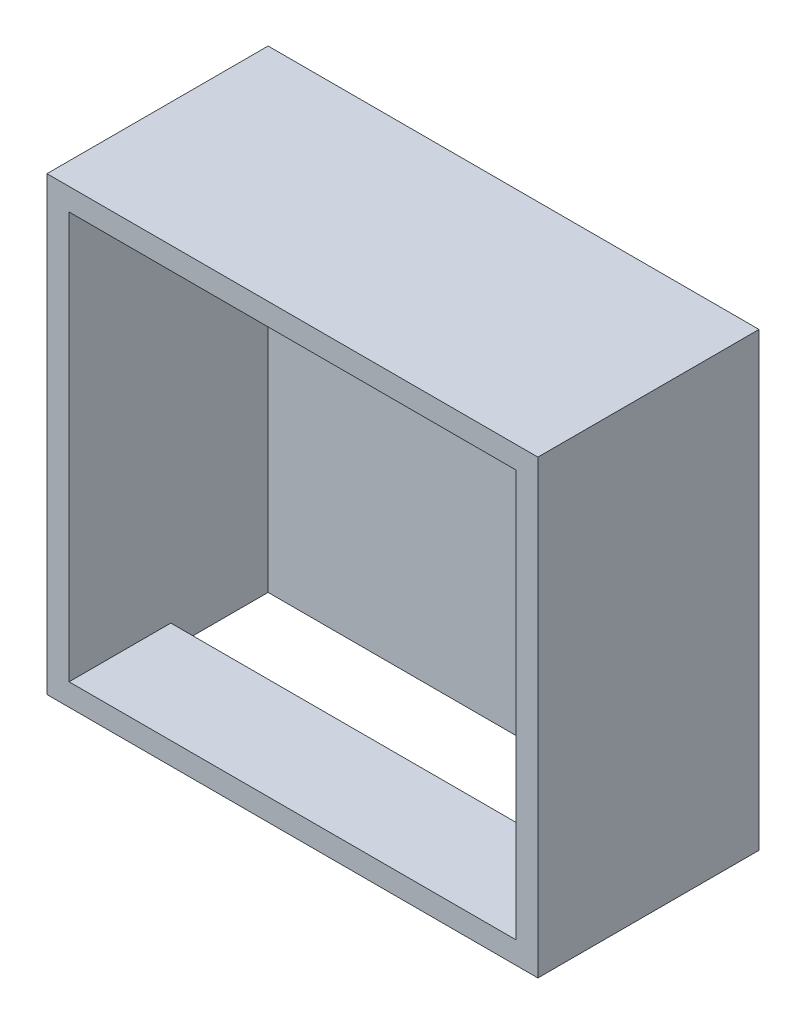
ISO-10303-21;
HEADER;
FILE_DESCRIPTION(('STEP AP214'),'2;1');
FILE_NAME('part.step','',(''),(''),'','','');
FILE_SCHEMA(('AUTOMOTIVE_DESIGN { 1 0 10303 214 1 1 1 1 }'));
ENDSEC;
DATA;
#1=APPLICATION_CONTEXT('core data for automotive mechanical design processes');
#2=APPLICATION_PROTOCOL_DEFINITION('international standard','automotive_design',2000,#1);
#3=PRODUCT_CONTEXT('',#1,'mechanical');
#4=PRODUCT('Part','Part','',(#3));
#5=PRODUCT_RELATED_PRODUCT_CATEGORY('part','',(#4));
#6=PRODUCT_DEFINITION_FORMATION('','',#4);
#7=PRODUCT_DEFINITION_CONTEXT('part definition',#1,'design');
#8=PRODUCT_DEFINITION('design','',#6,#7);
#9=PRODUCT_DEFINITION_SHAPE('','',#8);
#10=(LENGTH_UNIT() NAMED_UNIT(*) SI_UNIT(.MILLI.,.METRE.));
#11=(NAMED_UNIT(*) PLANE_ANGLE_UNIT() SI_UNIT($,.RADIAN.));
#12=(NAMED_UNIT(*) SI_UNIT($,.STERADIAN.) SOLID_ANGLE_UNIT());
#13=UNCERTAINTY_MEASURE_WITH_UNIT(LENGTH_MEASURE(1.E-05),#10,'distance_accuracy_value','');
#14=(GEOMETRIC_REPRESENTATION_CONTEXT(3) GLOBAL_UNCERTAINTY_ASSIGNED_CONTEXT((#13)) GLOBAL_UNIT_ASSIGNED_CONTEXT((#10,
#11,#12)) REPRESENTATION_CONTEXT('',''));
#15=CARTESIAN_POINT('',(0.,0.,0.));
#16=DIRECTION('',(0.,0.,1.));
#17=DIRECTION('',(1.,0.,0.));
#18=AXIS2_PLACEMENT_3D('',#15,#16,#17);
#19=CARTESIAN_POINT('',(-77.5811200753142,47.4278777315151,45.));
#20=DIRECTION('',(1.,0.,0.));
#21=DIRECTION('',(0.,0.,-1.));
#22=AXIS2_PLACEMENT_3D('',#19,#20,#21);
#23=PLANE('',#22);
#24=DIRECTION('',(0.,-1.,0.));
#25=VECTOR('',#24,1.);
#26=CARTESIAN_POINT('',(-77.5811200753142,47.4278777315151,0.));
#27=LINE('',#26,#25);
#28=CARTESIAN_POINT('',(-77.5811200753142,38.4278777315151,0.));
#29=VERTEX_POINT('',#28);
#30=CARTESIAN_POINT('',(-77.5811200753143,-49.5721222684849,0.));
#31=VERTEX_POINT('',#30);
#32=EDGE_CURVE('E136',#29,#31,#27,.T.);
#33=ORIENTED_EDGE('',*,*,#32,.F.);
#34=DIRECTION('',(0.,0.,-1.));
#35=VECTOR('',#34,1.);
#36=CARTESIAN_POINT('',(-77.5811200753142,38.4278777315151,8.));
#37=LINE('',#36,#35);
#38=CARTESIAN_POINT('',(-77.5811200753142,38.4278777315151,8.));
#39=VERTEX_POINT('',#38);
#40=EDGE_CURVE('E53',#39,#29,#37,.T.);
#41=ORIENTED_EDGE('',*,*,#40,.F.);
#42=DIRECTION('',(0.,-1.,0.));
#43=VECTOR('',#42,1.);
#44=CARTESIAN_POINT('',(-77.5811200753142,47.4278777315151,8.));
#45=LINE('',#44,#43);
#46=CARTESIAN_POINT('',(-77.5811200753142,47.4278777315151,8.00000000000001));
#47=VERTEX_POINT('',#46);
#48=EDGE_CURVE('E381',#47,#39,#45,.T.);
#49=ORIENTED_EDGE('',*,*,#48,.F.);
#50=DIRECTION('',(0.,0.,-1.));
#51=VECTOR('',#50,1.);
#52=CARTESIAN_POINT('',(-77.5811200753142,47.4278777315151,45.));
#53=LINE('',#52,#51);
#54=CARTESIAN_POINT('',(-77.5811200753142,47.4278777315151,45.));
#55=VERTEX_POINT('',#54);
#56=EDGE_CURVE('E190',#55,#47,#53,.T.);
#57=ORIENTED_EDGE('',*,*,#56,.F.);
#58=DIRECTION('',(0.,-1.,0.));
#59=VECTOR('',#58,1.);
#60=CARTESIAN_POINT('',(-77.5811200753142,47.4278777315151,45.));
#61=LINE('',#60,#59);
#62=CARTESIAN_POINT('',(-77.5811200753142,-44.5721222684849,45.));
#63=VERTEX_POINT('',#62);
#64=EDGE_CURVE('E135',#55,#63,#61,.T.);
#65=ORIENTED_EDGE('',*,*,#64,.T.);
#66=DIRECTION('',(0.,0.,-1.));
#67=VECTOR('',#66,1.);
#68=CARTESIAN_POINT('',(-77.5811200753142,-44.5721222684849,45.));
#69=LINE('',#68,#67);
#70=CARTESIAN_POINT('',(-77.5811200753143,-44.5721222684849,22.));
#71=VERTEX_POINT('',#70);
#72=EDGE_CURVE('E199',#63,#71,#69,.T.);
#73=ORIENTED_EDGE('',*,*,#72,.T.);
#74=DIRECTION('',(0.,-1.,0.));
#75=VECTOR('',#74,1.);
#76=CARTESIAN_POINT('',(-77.5811200753143,-44.5721222684849,22.));
#77=LINE('',#76,#75);
#78=CARTESIAN_POINT('',(-77.5811200753143,-49.5721222684849,22.));
#79=VERTEX_POINT('',#78);
#80=EDGE_CURVE('E166',#71,#79,#77,.T.);
#81=ORIENTED_EDGE('',*,*,#80,.T.);
#82=DIRECTION('',(0.,0.,-1.));
#83=VECTOR('',#82,1.);
#84=CARTESIAN_POINT('',(-77.5811200753143,-49.5721222684849,0.));
#85=LINE('',#84,#83);
#86=EDGE_CURVE('E162',#79,#31,#85,.T.);
#87=ORIENTED_EDGE('',*,*,#86,.T.);
#88=EDGE_LOOP('',(#33,#41,#49,#57,#65,#73,#81,#87));
#89=FACE_BOUND('',#88,.T.);
#90=ADVANCED_FACE('F38',(#89),#23,.T.);
#91=CARTESIAN_POINT('',(23.4188799246858,47.4278777315151,45.));
#92=DIRECTION('',(-1.,0.,0.));
#93=DIRECTION('',(0.,-1.,0.));
#94=AXIS2_PLACEMENT_3D('',#91,#92,#93);
#95=PLANE('',#94);
#96=DIRECTION('',(0.,1.,0.));
#97=VECTOR('',#96,1.);
#98=CARTESIAN_POINT('',(23.4188799246858,47.4278777315151,8.));
#99=LINE('',#98,#97);
#100=CARTESIAN_POINT('',(23.4188799246858,38.4278777315151,8.));
#101=VERTEX_POINT('',#100);
#102=CARTESIAN_POINT('',(23.4188799246858,47.4278777315151,8.00000000000001));
#103=VERTEX_POINT('',#102);
#104=EDGE_CURVE('E61',#101,#103,#99,.T.);
#105=ORIENTED_EDGE('',*,*,#104,.F.);
#106=DIRECTION('',(0.,0.,-1.));
#107=VECTOR('',#106,1.);
#108=CARTESIAN_POINT('',(23.4188799246858,38.4278777315151,8.));
#109=LINE('',#108,#107);
#110=CARTESIAN_POINT('',(23.4188799246858,38.4278777315151,0.));
#111=VERTEX_POINT('',#110);
#112=EDGE_CURVE('E139',#101,#111,#109,.T.);
#113=ORIENTED_EDGE('',*,*,#112,.T.);
#114=DIRECTION('',(0.,1.,0.));
#115=VECTOR('',#114,1.);
#116=CARTESIAN_POINT('',(23.4188799246858,47.4278777315151,0.));
#117=LINE('',#116,#115);
#118=CARTESIAN_POINT('',(23.4188799246858,-49.5721222684849,0.));
#119=VERTEX_POINT('',#118);
#120=EDGE_CURVE('E128',#119,#111,#117,.T.);
#121=ORIENTED_EDGE('',*,*,#120,.F.);
#122=DIRECTION('',(0.,0.,1.));
#123=VECTOR('',#122,1.);
#124=CARTESIAN_POINT('',(23.4188799246858,-49.5721222684849,0.));
#125=LINE('',#124,#123);
#126=CARTESIAN_POINT('',(23.4188799246857,-49.5721222684849,22.));
#127=VERTEX_POINT('',#126);
#128=EDGE_CURVE('E153',#119,#127,#125,.T.);
#129=ORIENTED_EDGE('',*,*,#128,.T.);
#130=DIRECTION('',(0.,-1.,0.));
#131=VECTOR('',#130,1.);
#132=CARTESIAN_POINT('',(23.4188799246858,-44.5721222684849,22.));
#133=LINE('',#132,#131);
#134=CARTESIAN_POINT('',(23.4188799246858,-44.5721222684849,22.));
#135=VERTEX_POINT('',#134);
#136=EDGE_CURVE('E157',#135,#127,#133,.T.);
#137=ORIENTED_EDGE('',*,*,#136,.F.);
#138=DIRECTION('',(0.,0.,-1.));
#139=VECTOR('',#138,1.);
#140=CARTESIAN_POINT('',(23.4188799246857,-44.5721222684849,45.));
#141=LINE('',#140,#139);
#142=CARTESIAN_POINT('',(23.4188799246857,-44.5721222684849,45.));
#143=VERTEX_POINT('',#142);
#144=EDGE_CURVE('E196',#143,#135,#141,.T.);
#145=ORIENTED_EDGE('',*,*,#144,.F.);
#146=DIRECTION('',(0.,1.,0.));
#147=VECTOR('',#146,1.);
#148=CARTESIAN_POINT('',(23.4188799246858,47.4278777315151,45.));
#149=LINE('',#148,#147);
#150=CARTESIAN_POINT('',(23.4188799246858,47.4278777315151,45.));
#151=VERTEX_POINT('',#150);
#152=EDGE_CURVE('E185',#143,#151,#149,.T.);
#153=ORIENTED_EDGE('',*,*,#152,.T.);
#154=DIRECTION('',(0.,0.,-1.));
#155=VECTOR('',#154,1.);
#156=CARTESIAN_POINT('',(23.4188799246858,47.4278777315151,45.));
#157=LINE('',#156,#155);
#158=EDGE_CURVE('E194',#151,#103,#157,.T.);
#159=ORIENTED_EDGE('',*,*,#158,.T.);
#160=EDGE_LOOP('',(#105,#113,#121,#129,#137,#145,#153,#159));
#161=FACE_BOUND('',#160,.T.);
#162=ADVANCED_FACE('F140',(#161),#95,.T.);
#163=CARTESIAN_POINT('',(-77.5811200753142,47.4278777315151,45.));
#164=DIRECTION('',(0.,-1.,0.));
#165=DIRECTION('',(1.,0.,0.));
#166=AXIS2_PLACEMENT_3D('',#163,#164,#165);
#167=PLANE('',#166);
#168=ORIENTED_EDGE('',*,*,#56,.T.);
#169=DIRECTION('',(-1.,0.,0.));
#170=VECTOR('',#169,1.);
#171=CARTESIAN_POINT('',(23.4188799246858,47.4278777315151,8.));
#172=LINE('',#171,#170);
#173=EDGE_CURVE('E147',#103,#47,#172,.T.);
#174=ORIENTED_EDGE('',*,*,#173,.F.);
#175=ORIENTED_EDGE('',*,*,#158,.F.);
#176=DIRECTION('',(-1.,0.,0.));
#177=VECTOR('',#176,1.);
#178=CARTESIAN_POINT('',(-77.5811200753142,47.4278777315151,45.));
#179=LINE('',#178,#177);
#180=EDGE_CURVE('E188',#151,#55,#179,.T.);
#181=ORIENTED_EDGE('',*,*,#180,.T.);
#182=EDGE_LOOP('',(#168,#174,#175,#181));
#183=FACE_BOUND('',#182,.T.);
#184=ADVANCED_FACE('F249',(#183),#167,.T.);
#185=CARTESIAN_POINT('',(0.,0.,0.));
#186=DIRECTION('',(0.,0.,-1.));
#187=DIRECTION('',(-1.,0.,0.));
#188=AXIS2_PLACEMENT_3D('',#185,#186,#187);
#189=PLANE('',#188);
#190=DIRECTION('',(1.,0.,0.));
#191=VECTOR('',#190,1.);
#192=CARTESIAN_POINT('',(23.4188799246858,38.4278777315151,0.));
#193=LINE('',#192,#191);
#194=EDGE_CURVE('E131',#29,#111,#193,.T.);
#195=ORIENTED_EDGE('',*,*,#194,.F.);
#196=ORIENTED_EDGE('',*,*,#32,.T.);
#197=DIRECTION('',(1.,0.,0.));
#198=VECTOR('',#197,1.);
#199=CARTESIAN_POINT('',(23.4188799246858,-49.5721222684849,0.));
#200=LINE('',#199,#198);
#201=EDGE_CURVE('E133',#31,#119,#200,.T.);
#202=ORIENTED_EDGE('',*,*,#201,.T.);
#203=ORIENTED_EDGE('',*,*,#120,.T.);
#204=EDGE_LOOP('',(#195,#196,#202,#203));
#205=FACE_BOUND('',#204,.T.);
#206=ADVANCED_FACE('F129',(#205),#189,.F.);
#207=CARTESIAN_POINT('',(0.,0.,45.));
#208=DIRECTION('',(0.,0.,1.));
#209=DIRECTION('',(1.,0.,0.));
#210=AXIS2_PLACEMENT_3D('',#207,#208,#209);
#211=PLANE('',#210);
#212=DIRECTION('',(0.,-1.,0.));
#213=VECTOR('',#212,1.);
#214=CARTESIAN_POINT('',(-82.5811200753143,52.4278777315151,45.));
#215=LINE('',#214,#213);
#216=CARTESIAN_POINT('',(-82.5811200753143,52.4278777315151,45.));
#217=VERTEX_POINT('',#216);
#218=CARTESIAN_POINT('',(-82.5811200753143,-49.5721222684849,45.));
#219=VERTEX_POINT('',#218);
#220=EDGE_CURVE('E202',#217,#219,#215,.T.);
#221=ORIENTED_EDGE('',*,*,#220,.T.);
#222=DIRECTION('',(1.,0.,0.));
#223=VECTOR('',#222,1.);
#224=CARTESIAN_POINT('',(-82.5811200753143,-49.5721222684849,45.));
#225=LINE('',#224,#223);
#226=CARTESIAN_POINT('',(28.4188799246858,-49.5721222684849,45.));
#227=VERTEX_POINT('',#226);
#228=EDGE_CURVE('E205',#219,#227,#225,.T.);
#229=ORIENTED_EDGE('',*,*,#228,.T.);
#230=DIRECTION('',(0.,1.,0.));
#231=VECTOR('',#230,1.);
#232=CARTESIAN_POINT('',(28.4188799246858,52.4278777315151,45.));
#233=LINE('',#232,#231);
#234=CARTESIAN_POINT('',(28.4188799246858,52.4278777315151,45.));
#235=VERTEX_POINT('',#234);
#236=EDGE_CURVE('E207',#227,#235,#233,.T.);
#237=ORIENTED_EDGE('',*,*,#236,.T.);
#238=DIRECTION('',(-1.,0.,0.));
#239=VECTOR('',#238,1.);
#240=CARTESIAN_POINT('',(-82.5811200753143,52.4278777315151,45.));
#241=LINE('',#240,#239);
#242=EDGE_CURVE('E209',#235,#217,#241,.T.);
#243=ORIENTED_EDGE('',*,*,#242,.T.);
#244=EDGE_LOOP('',(#221,#229,#237,#243));
#245=FACE_BOUND('',#244,.T.);
#246=DIRECTION('',(1.,0.,0.));
#247=VECTOR('',#246,1.);
#248=CARTESIAN_POINT('',(-77.5811200753142,-44.5721222684849,45.));
#249=LINE('',#248,#247);
#250=EDGE_CURVE('E183',#63,#143,#249,.T.);
#251=ORIENTED_EDGE('',*,*,#250,.F.);
#252=ORIENTED_EDGE('',*,*,#64,.F.);
#253=ORIENTED_EDGE('',*,*,#180,.F.);
#254=ORIENTED_EDGE('',*,*,#152,.F.);
#255=EDGE_LOOP('',(#251,#252,#253,#254));
#256=FACE_BOUND('',#255,.T.);
#257=ADVANCED_FACE('F234',(#245,#256),#211,.T.);
#258=CARTESIAN_POINT('',(-82.5811200753143,52.4278777315151,45.));
#259=DIRECTION('',(1.,0.,0.));
#260=DIRECTION('',(0.,0.,-1.));
#261=AXIS2_PLACEMENT_3D('',#258,#259,#260);
#262=PLANE('',#261);
#263=DIRECTION('',(0.,0.,-1.));
#264=VECTOR('',#263,1.);
#265=CARTESIAN_POINT('',(-82.5811200753143,52.4278777315151,45.));
#266=LINE('',#265,#264);
#267=CARTESIAN_POINT('',(-82.5811200753143,52.4278777315151,-5.));
#268=VERTEX_POINT('',#267);
#269=EDGE_CURVE('E211',#217,#268,#266,.T.);
#270=ORIENTED_EDGE('',*,*,#269,.T.);
#271=DIRECTION('',(0.,1.,0.));
#272=VECTOR('',#271,1.);
#273=CARTESIAN_POINT('',(-82.5811200753143,52.4278777315151,-5.));
#274=LINE('',#273,#272);
#275=CARTESIAN_POINT('',(-82.5811200753143,-49.5721222684849,-5.));
#276=VERTEX_POINT('',#275);
#277=EDGE_CURVE('E176',#276,#268,#274,.T.);
#278=ORIENTED_EDGE('',*,*,#277,.F.);
#279=DIRECTION('',(0.,0.,-1.));
#280=VECTOR('',#279,1.);
#281=CARTESIAN_POINT('',(-82.5811200753143,-49.5721222684849,45.));
#282=LINE('',#281,#280);
#283=EDGE_CURVE('E11',#219,#276,#282,.T.);
#284=ORIENTED_EDGE('',*,*,#283,.F.);
#285=ORIENTED_EDGE('',*,*,#220,.F.);
#286=EDGE_LOOP('',(#270,#278,#284,#285));
#287=FACE_BOUND('',#286,.T.);
#288=ADVANCED_FACE('F40',(#287),#262,.F.);
#289=CARTESIAN_POINT('',(-82.5811200753143,-49.5721222684849,45.));
#290=DIRECTION('',(0.,1.,0.));
#291=DIRECTION('',(0.,0.,1.));
#292=AXIS2_PLACEMENT_3D('',#289,#290,#291);
#293=PLANE('',#292);
#294=DIRECTION('',(-1.,0.,0.));
#295=VECTOR('',#294,1.);
#296=CARTESIAN_POINT('',(23.4188799246858,-49.5721222684849,22.));
#297=LINE('',#296,#295);
#298=EDGE_CURVE('E159',#127,#79,#297,.T.);
#299=ORIENTED_EDGE('',*,*,#298,.F.);
#300=ORIENTED_EDGE('',*,*,#128,.F.);
#301=ORIENTED_EDGE('',*,*,#201,.F.);
#302=ORIENTED_EDGE('',*,*,#86,.F.);
#303=EDGE_LOOP('',(#299,#300,#301,#302));
#304=FACE_BOUND('',#303,.T.);
#305=ORIENTED_EDGE('',*,*,#283,.T.);
#306=DIRECTION('',(-1.,0.,0.));
#307=VECTOR('',#306,1.);
#308=CARTESIAN_POINT('',(28.4188799246857,-49.5721222684849,-5.));
#309=LINE('',#308,#307);
#310=CARTESIAN_POINT('',(28.4188799246857,-49.5721222684849,-5.));
#311=VERTEX_POINT('',#310);
#312=EDGE_CURVE('E173',#311,#276,#309,.T.);
#313=ORIENTED_EDGE('',*,*,#312,.F.);
#314=DIRECTION('',(0.,0.,-1.));
#315=VECTOR('',#314,1.);
#316=CARTESIAN_POINT('',(28.4188799246858,-49.5721222684849,45.));
#317=LINE('',#316,#315);
#318=EDGE_CURVE('E46',#227,#311,#317,.T.);
#319=ORIENTED_EDGE('',*,*,#318,.F.);
#320=ORIENTED_EDGE('',*,*,#228,.F.);
#321=EDGE_LOOP('',(#305,#313,#319,#320));
#322=FACE_BOUND('',#321,.T.);
#323=ADVANCED_FACE('F222',(#304,#322),#293,.F.);
#324=CARTESIAN_POINT('',(28.4188799246858,52.4278777315151,45.));
#325=DIRECTION('',(-1.,0.,0.));
#326=DIRECTION('',(0.,-1.,0.));
#327=AXIS2_PLACEMENT_3D('',#324,#325,#326);
#328=PLANE('',#327);
#329=ORIENTED_EDGE('',*,*,#318,.T.);
#330=DIRECTION('',(0.,-1.,0.));
#331=VECTOR('',#330,1.);
#332=CARTESIAN_POINT('',(28.4188799246858,52.4278777315151,-5.));
#333=LINE('',#332,#331);
#334=CARTESIAN_POINT('',(28.4188799246858,52.4278777315151,-5.));
#335=VERTEX_POINT('',#334);
#336=EDGE_CURVE('E168',#335,#311,#333,.T.);
#337=ORIENTED_EDGE('',*,*,#336,.F.);
#338=DIRECTION('',(0.,0.,-1.));
#339=VECTOR('',#338,1.);
#340=CARTESIAN_POINT('',(28.4188799246858,52.4278777315151,45.));
#341=LINE('',#340,#339);
#342=EDGE_CURVE('E213',#235,#335,#341,.T.);
#343=ORIENTED_EDGE('',*,*,#342,.F.);
#344=ORIENTED_EDGE('',*,*,#236,.F.);
#345=EDGE_LOOP('',(#329,#337,#343,#344));
#346=FACE_BOUND('',#345,.T.);
#347=ADVANCED_FACE('F219',(#346),#328,.F.);
#348=CARTESIAN_POINT('',(-82.5811200753143,52.4278777315151,45.));
#349=DIRECTION('',(0.,-1.,0.));
#350=DIRECTION('',(0.,0.,-1.));
#351=AXIS2_PLACEMENT_3D('',#348,#349,#350);
#352=PLANE('',#351);
#353=ORIENTED_EDGE('',*,*,#342,.T.);
#354=DIRECTION('',(1.,0.,0.));
#355=VECTOR('',#354,1.);
#356=CARTESIAN_POINT('',(28.4188799246858,52.4278777315151,-5.));
#357=LINE('',#356,#355);
#358=EDGE_CURVE('E179',#268,#335,#357,.T.);
#359=ORIENTED_EDGE('',*,*,#358,.F.);
#360=ORIENTED_EDGE('',*,*,#269,.F.);
#361=ORIENTED_EDGE('',*,*,#242,.F.);
#362=EDGE_LOOP('',(#353,#359,#360,#361));
#363=FACE_BOUND('',#362,.T.);
#364=ADVANCED_FACE('F230',(#363),#352,.F.);
#365=CARTESIAN_POINT('',(-77.5811200753142,-44.5721222684849,45.));
#366=DIRECTION('',(0.,1.,0.));
#367=DIRECTION('',(0.,0.,1.));
#368=AXIS2_PLACEMENT_3D('',#365,#366,#367);
#369=PLANE('',#368);
#370=DIRECTION('',(-1.,0.,0.));
#371=VECTOR('',#370,1.);
#372=CARTESIAN_POINT('',(23.4188799246858,-44.5721222684849,22.));
#373=LINE('',#372,#371);
#374=EDGE_CURVE('E154',#135,#71,#373,.T.);
#375=ORIENTED_EDGE('',*,*,#374,.T.);
#376=ORIENTED_EDGE('',*,*,#72,.F.);
#377=ORIENTED_EDGE('',*,*,#250,.T.);
#378=ORIENTED_EDGE('',*,*,#144,.T.);
#379=EDGE_LOOP('',(#375,#376,#377,#378));
#380=FACE_BOUND('',#379,.T.);
#381=ADVANCED_FACE('F252',(#380),#369,.T.);
#382=CARTESIAN_POINT('',(0.,0.,-5.));
#383=DIRECTION('',(0.,0.,-1.));
#384=DIRECTION('',(-1.,0.,0.));
#385=AXIS2_PLACEMENT_3D('',#382,#383,#384);
#386=PLANE('',#385);
#387=ORIENTED_EDGE('',*,*,#336,.T.);
#388=ORIENTED_EDGE('',*,*,#312,.T.);
#389=ORIENTED_EDGE('',*,*,#277,.T.);
#390=ORIENTED_EDGE('',*,*,#358,.T.);
#391=EDGE_LOOP('',(#387,#388,#389,#390));
#392=FACE_BOUND('',#391,.T.);
#393=ADVANCED_FACE('F226',(#392),#386,.T.);
#394=CARTESIAN_POINT('',(23.4188799246858,-44.5721222684849,22.));
#395=DIRECTION('',(0.,0.,1.));
#396=DIRECTION('',(1.,0.,0.));
#397=AXIS2_PLACEMENT_3D('',#394,#395,#396);
#398=PLANE('',#397);
#399=ORIENTED_EDGE('',*,*,#298,.T.);
#400=ORIENTED_EDGE('',*,*,#80,.F.);
#401=ORIENTED_EDGE('',*,*,#374,.F.);
#402=ORIENTED_EDGE('',*,*,#136,.T.);
#403=EDGE_LOOP('',(#399,#400,#401,#402));
#404=FACE_BOUND('',#403,.T.);
#405=ADVANCED_FACE('F278',(#404),#398,.F.);
#406=CARTESIAN_POINT('',(23.4188799246858,38.4278777315151,8.));
#407=DIRECTION('',(0.,1.,0.));
#408=DIRECTION('',(-1.,0.,0.));
#409=AXIS2_PLACEMENT_3D('',#406,#407,#408);
#410=PLANE('',#409);
#411=ORIENTED_EDGE('',*,*,#194,.T.);
#412=ORIENTED_EDGE('',*,*,#112,.F.);
#413=DIRECTION('',(1.,0.,0.));
#414=VECTOR('',#413,1.);
#415=CARTESIAN_POINT('',(23.4188799246858,38.4278777315151,8.));
#416=LINE('',#415,#414);
#417=EDGE_CURVE('E143',#39,#101,#416,.T.);
#418=ORIENTED_EDGE('',*,*,#417,.F.);
#419=ORIENTED_EDGE('',*,*,#40,.T.);
#420=EDGE_LOOP('',(#411,#412,#418,#419));
#421=FACE_BOUND('',#420,.T.);
#422=ADVANCED_FACE('F145',(#421),#410,.F.);
#423=CARTESIAN_POINT('',(0.,0.,8.));
#424=DIRECTION('',(0.,0.,-1.));
#425=DIRECTION('',(-1.,0.,0.));
#426=AXIS2_PLACEMENT_3D('',#423,#424,#425);
#427=PLANE('',#426);
#428=ORIENTED_EDGE('',*,*,#104,.T.);
#429=ORIENTED_EDGE('',*,*,#173,.T.);
#430=ORIENTED_EDGE('',*,*,#48,.T.);
#431=ORIENTED_EDGE('',*,*,#417,.T.);
#432=EDGE_LOOP('',(#428,#429,#430,#431));
#433=FACE_BOUND('',#432,.T.);
#434=ADVANCED_FACE('F291',(#433),#427,.F.);
#435=CLOSED_SHELL('',(#90,#162,#184,#206,#257,#288,#323,#347,#364,#381,#393,#405,#422,#434));
#436=MANIFOLD_SOLID_BREP('B2',#435);
#437=ADVANCED_BREP_SHAPE_REPRESENTATION('',(#18,#436),#14);
#438=SHAPE_DEFINITION_REPRESENTATION(#9,#437);
ENDSEC;
END-ISO-10303-21;
